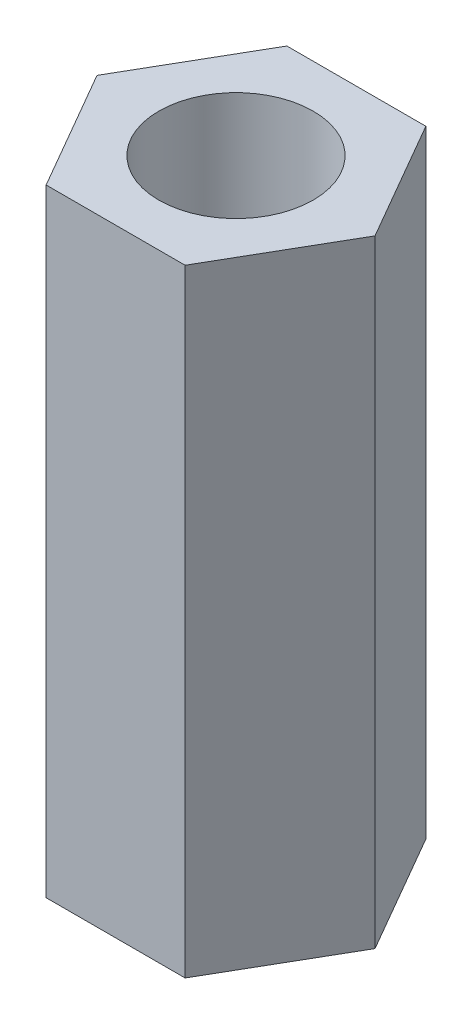
ISO-10303-21;
HEADER;
FILE_DESCRIPTION(('STEP AP214'),'2;1');
FILE_NAME('part.step','',(''),(''),'','','');
FILE_SCHEMA(('AUTOMOTIVE_DESIGN { 1 0 10303 214 1 1 1 1 }'));
ENDSEC;
DATA;
#1=APPLICATION_CONTEXT('core data for automotive mechanical design processes');
#2=APPLICATION_PROTOCOL_DEFINITION('international standard','automotive_design',2000,#1);
#3=PRODUCT_CONTEXT('',#1,'mechanical');
#4=PRODUCT('Part','Part','',(#3));
#5=PRODUCT_RELATED_PRODUCT_CATEGORY('part','',(#4));
#6=PRODUCT_DEFINITION_FORMATION('','',#4);
#7=PRODUCT_DEFINITION_CONTEXT('part definition',#1,'design');
#8=PRODUCT_DEFINITION('design','',#6,#7);
#9=PRODUCT_DEFINITION_SHAPE('','',#8);
#10=(LENGTH_UNIT() NAMED_UNIT(*) SI_UNIT(.MILLI.,.METRE.));
#11=(NAMED_UNIT(*) PLANE_ANGLE_UNIT() SI_UNIT($,.RADIAN.));
#12=(NAMED_UNIT(*) SI_UNIT($,.STERADIAN.) SOLID_ANGLE_UNIT());
#13=UNCERTAINTY_MEASURE_WITH_UNIT(LENGTH_MEASURE(1.E-05),#10,'distance_accuracy_value','');
#14=(GEOMETRIC_REPRESENTATION_CONTEXT(3) GLOBAL_UNCERTAINTY_ASSIGNED_CONTEXT((#13)) GLOBAL_UNIT_ASSIGNED_CONTEXT((#10,
#11,#12)) REPRESENTATION_CONTEXT('',''));
#15=CARTESIAN_POINT('',(0.,0.,0.));
#16=DIRECTION('',(0.,0.,1.));
#17=DIRECTION('',(1.,0.,0.));
#18=AXIS2_PLACEMENT_3D('',#15,#16,#17);
#19=CARTESIAN_POINT('',(1.12583302491977,10.,1.95));
#20=DIRECTION('',(-0.866025403784439,0.,-0.5));
#21=DIRECTION('',(-0.5,0.,0.866025403784439));
#22=AXIS2_PLACEMENT_3D('',#19,#20,#21);
#23=PLANE('',#22);
#24=DIRECTION('',(0.5,0.,-0.866025403784439));
#25=VECTOR('',#24,1.);
#26=CARTESIAN_POINT('',(1.12583302491977,0.,1.95));
#27=LINE('',#26,#25);
#28=CARTESIAN_POINT('',(1.12583302491977,0.,1.95));
#29=VERTEX_POINT('',#28);
#30=CARTESIAN_POINT('',(2.25166604983954,0.,0.));
#31=VERTEX_POINT('',#30);
#32=EDGE_CURVE('E119',#29,#31,#27,.T.);
#33=ORIENTED_EDGE('',*,*,#32,.T.);
#34=DIRECTION('',(0.,-1.,0.));
#35=VECTOR('',#34,1.);
#36=CARTESIAN_POINT('',(2.25166604983954,10.,0.));
#37=LINE('',#36,#35);
#38=CARTESIAN_POINT('',(2.25166604983954,10.,0.));
#39=VERTEX_POINT('',#38);
#40=EDGE_CURVE('E11',#39,#31,#37,.T.);
#41=ORIENTED_EDGE('',*,*,#40,.F.);
#42=DIRECTION('',(0.5,0.,-0.866025403784439));
#43=VECTOR('',#42,1.);
#44=CARTESIAN_POINT('',(1.12583302491977,10.,1.95));
#45=LINE('',#44,#43);
#46=CARTESIAN_POINT('',(1.12583302491977,10.,1.95));
#47=VERTEX_POINT('',#46);
#48=EDGE_CURVE('E130',#47,#39,#45,.T.);
#49=ORIENTED_EDGE('',*,*,#48,.F.);
#50=DIRECTION('',(0.,-1.,0.));
#51=VECTOR('',#50,1.);
#52=CARTESIAN_POINT('',(1.12583302491977,10.,1.95));
#53=LINE('',#52,#51);
#54=EDGE_CURVE('E115',#47,#29,#53,.T.);
#55=ORIENTED_EDGE('',*,*,#54,.T.);
#56=EDGE_LOOP('',(#33,#41,#49,#55));
#57=FACE_BOUND('',#56,.T.);
#58=ADVANCED_FACE('F35',(#57),#23,.F.);
#59=CARTESIAN_POINT('',(2.25166604983954,10.,0.));
#60=DIRECTION('',(-0.866025403784439,0.,0.5));
#61=DIRECTION('',(0.5,0.,0.866025403784439));
#62=AXIS2_PLACEMENT_3D('',#59,#60,#61);
#63=PLANE('',#62);
#64=DIRECTION('',(-0.5,0.,-0.866025403784439));
#65=VECTOR('',#64,1.);
#66=CARTESIAN_POINT('',(2.25166604983954,0.,0.));
#67=LINE('',#66,#65);
#68=CARTESIAN_POINT('',(1.12583302491977,0.,-1.95));
#69=VERTEX_POINT('',#68);
#70=EDGE_CURVE('E122',#31,#69,#67,.T.);
#71=ORIENTED_EDGE('',*,*,#70,.T.);
#72=DIRECTION('',(0.,-1.,0.));
#73=VECTOR('',#72,1.);
#74=CARTESIAN_POINT('',(1.12583302491977,10.,-1.95));
#75=LINE('',#74,#73);
#76=CARTESIAN_POINT('',(1.12583302491977,10.,-1.95));
#77=VERTEX_POINT('',#76);
#78=EDGE_CURVE('E43',#77,#69,#75,.T.);
#79=ORIENTED_EDGE('',*,*,#78,.F.);
#80=DIRECTION('',(-0.5,0.,-0.866025403784439));
#81=VECTOR('',#80,1.);
#82=CARTESIAN_POINT('',(2.25166604983954,10.,0.));
#83=LINE('',#82,#81);
#84=EDGE_CURVE('E88',#39,#77,#83,.T.);
#85=ORIENTED_EDGE('',*,*,#84,.F.);
#86=ORIENTED_EDGE('',*,*,#40,.T.);
#87=EDGE_LOOP('',(#71,#79,#85,#86));
#88=FACE_BOUND('',#87,.T.);
#89=ADVANCED_FACE('F155',(#88),#63,.F.);
#90=CARTESIAN_POINT('',(1.12583302491977,10.,-1.95));
#91=DIRECTION('',(0.,0.,1.));
#92=DIRECTION('',(1.,0.,0.));
#93=AXIS2_PLACEMENT_3D('',#90,#91,#92);
#94=PLANE('',#93);
#95=DIRECTION('',(-1.,0.,0.));
#96=VECTOR('',#95,1.);
#97=CARTESIAN_POINT('',(1.12583302491977,0.,-1.95));
#98=LINE('',#97,#96);
#99=CARTESIAN_POINT('',(-1.12583302491977,0.,-1.95));
#100=VERTEX_POINT('',#99);
#101=EDGE_CURVE('E125',#69,#100,#98,.T.);
#102=ORIENTED_EDGE('',*,*,#101,.T.);
#103=DIRECTION('',(0.,-1.,0.));
#104=VECTOR('',#103,1.);
#105=CARTESIAN_POINT('',(-1.12583302491977,10.,-1.95));
#106=LINE('',#105,#104);
#107=CARTESIAN_POINT('',(-1.12583302491977,10.,-1.95));
#108=VERTEX_POINT('',#107);
#109=EDGE_CURVE('E110',#108,#100,#106,.T.);
#110=ORIENTED_EDGE('',*,*,#109,.F.);
#111=DIRECTION('',(-1.,0.,0.));
#112=VECTOR('',#111,1.);
#113=CARTESIAN_POINT('',(1.12583302491977,10.,-1.95));
#114=LINE('',#113,#112);
#115=EDGE_CURVE('E101',#77,#108,#114,.T.);
#116=ORIENTED_EDGE('',*,*,#115,.F.);
#117=ORIENTED_EDGE('',*,*,#78,.T.);
#118=EDGE_LOOP('',(#102,#110,#116,#117));
#119=FACE_BOUND('',#118,.T.);
#120=ADVANCED_FACE('F136',(#119),#94,.F.);
#121=CARTESIAN_POINT('',(-1.12583302491977,10.,-1.95));
#122=DIRECTION('',(0.866025403784439,0.,0.5));
#123=DIRECTION('',(0.5,0.,-0.866025403784439));
#124=AXIS2_PLACEMENT_3D('',#121,#122,#123);
#125=PLANE('',#124);
#126=DIRECTION('',(-0.5,0.,0.866025403784439));
#127=VECTOR('',#126,1.);
#128=CARTESIAN_POINT('',(-1.12583302491977,0.,-1.95));
#129=LINE('',#128,#127);
#130=CARTESIAN_POINT('',(-2.25166604983954,0.,0.));
#131=VERTEX_POINT('',#130);
#132=EDGE_CURVE('E109',#100,#131,#129,.T.);
#133=ORIENTED_EDGE('',*,*,#132,.T.);
#134=DIRECTION('',(0.,-1.,0.));
#135=VECTOR('',#134,1.);
#136=CARTESIAN_POINT('',(-2.25166604983954,10.,0.));
#137=LINE('',#136,#135);
#138=CARTESIAN_POINT('',(-2.25166604983954,10.,0.));
#139=VERTEX_POINT('',#138);
#140=EDGE_CURVE('E106',#139,#131,#137,.T.);
#141=ORIENTED_EDGE('',*,*,#140,.F.);
#142=DIRECTION('',(-0.5,0.,0.866025403784439));
#143=VECTOR('',#142,1.);
#144=CARTESIAN_POINT('',(-1.12583302491977,10.,-1.95));
#145=LINE('',#144,#143);
#146=EDGE_CURVE('E95',#108,#139,#145,.T.);
#147=ORIENTED_EDGE('',*,*,#146,.F.);
#148=ORIENTED_EDGE('',*,*,#109,.T.);
#149=EDGE_LOOP('',(#133,#141,#147,#148));
#150=FACE_BOUND('',#149,.T.);
#151=ADVANCED_FACE('F107',(#150),#125,.F.);
#152=CARTESIAN_POINT('',(-2.25166604983954,10.,0.));
#153=DIRECTION('',(0.866025403784439,0.,-0.5));
#154=DIRECTION('',(-0.5,0.,-0.866025403784439));
#155=AXIS2_PLACEMENT_3D('',#152,#153,#154);
#156=PLANE('',#155);
#157=DIRECTION('',(0.5,0.,0.866025403784439));
#158=VECTOR('',#157,1.);
#159=CARTESIAN_POINT('',(-2.25166604983954,0.,0.));
#160=LINE('',#159,#158);
#161=CARTESIAN_POINT('',(-1.12583302491977,0.,1.95));
#162=VERTEX_POINT('',#161);
#163=EDGE_CURVE('E74',#131,#162,#160,.T.);
#164=ORIENTED_EDGE('',*,*,#163,.T.);
#165=DIRECTION('',(0.,-1.,0.));
#166=VECTOR('',#165,1.);
#167=CARTESIAN_POINT('',(-1.12583302491977,10.,1.95));
#168=LINE('',#167,#166);
#169=CARTESIAN_POINT('',(-1.12583302491977,10.,1.95));
#170=VERTEX_POINT('',#169);
#171=EDGE_CURVE('E111',#170,#162,#168,.T.);
#172=ORIENTED_EDGE('',*,*,#171,.F.);
#173=DIRECTION('',(0.5,0.,0.866025403784439));
#174=VECTOR('',#173,1.);
#175=CARTESIAN_POINT('',(-2.25166604983954,10.,0.));
#176=LINE('',#175,#174);
#177=EDGE_CURVE('E99',#139,#170,#176,.T.);
#178=ORIENTED_EDGE('',*,*,#177,.F.);
#179=ORIENTED_EDGE('',*,*,#140,.T.);
#180=EDGE_LOOP('',(#164,#172,#178,#179));
#181=FACE_BOUND('',#180,.T.);
#182=ADVANCED_FACE('F113',(#181),#156,.F.);
#183=CARTESIAN_POINT('',(-1.12583302491977,10.,1.95));
#184=DIRECTION('',(0.,0.,-1.));
#185=DIRECTION('',(-1.,0.,0.));
#186=AXIS2_PLACEMENT_3D('',#183,#184,#185);
#187=PLANE('',#186);
#188=DIRECTION('',(1.,0.,0.));
#189=VECTOR('',#188,1.);
#190=CARTESIAN_POINT('',(-1.12583302491977,0.,1.95));
#191=LINE('',#190,#189);
#192=EDGE_CURVE('E80',#162,#29,#191,.T.);
#193=ORIENTED_EDGE('',*,*,#192,.T.);
#194=ORIENTED_EDGE('',*,*,#54,.F.);
#195=DIRECTION('',(1.,0.,0.));
#196=VECTOR('',#195,1.);
#197=CARTESIAN_POINT('',(-1.12583302491977,10.,1.95));
#198=LINE('',#197,#196);
#199=EDGE_CURVE('E51',#170,#47,#198,.T.);
#200=ORIENTED_EDGE('',*,*,#199,.F.);
#201=ORIENTED_EDGE('',*,*,#171,.T.);
#202=EDGE_LOOP('',(#193,#194,#200,#201));
#203=FACE_BOUND('',#202,.T.);
#204=ADVANCED_FACE('F143',(#203),#187,.F.);
#205=CARTESIAN_POINT('',(0.,10.,0.));
#206=DIRECTION('',(0.,1.,0.));
#207=DIRECTION('',(0.,0.,1.));
#208=AXIS2_PLACEMENT_3D('',#205,#206,#207);
#209=PLANE('',#208);
#210=CARTESIAN_POINT('',(0.,10.,0.));
#211=DIRECTION('',(0.,1.,0.));
#212=DIRECTION('',(0.,0.,1.));
#213=AXIS2_PLACEMENT_3D('',#210,#211,#212);
#214=CIRCLE('',#213,1.25);
#215=CARTESIAN_POINT('',(0.,10.,1.25));
#216=VERTEX_POINT('',#215);
#217=EDGE_CURVE('E210',#216,#216,#214,.T.);
#218=ORIENTED_EDGE('',*,*,#217,.F.);
#219=EDGE_LOOP('',(#218));
#220=FACE_BOUND('',#219,.T.);
#221=ORIENTED_EDGE('',*,*,#48,.T.);
#222=ORIENTED_EDGE('',*,*,#84,.T.);
#223=ORIENTED_EDGE('',*,*,#115,.T.);
#224=ORIENTED_EDGE('',*,*,#146,.T.);
#225=ORIENTED_EDGE('',*,*,#177,.T.);
#226=ORIENTED_EDGE('',*,*,#199,.T.);
#227=EDGE_LOOP('',(#221,#222,#223,#224,#225,#226));
#228=FACE_BOUND('',#227,.T.);
#229=ADVANCED_FACE('F97',(#220,#228),#209,.T.);
#230=CARTESIAN_POINT('',(0.,0.,0.));
#231=DIRECTION('',(0.,1.,0.));
#232=DIRECTION('',(0.,0.,1.));
#233=AXIS2_PLACEMENT_3D('',#230,#231,#232);
#234=PLANE('',#233);
#235=CARTESIAN_POINT('',(0.,0.,0.));
#236=DIRECTION('',(0.,1.,0.));
#237=DIRECTION('',(0.,0.,1.));
#238=AXIS2_PLACEMENT_3D('',#235,#236,#237);
#239=CIRCLE('',#238,1.25);
#240=CARTESIAN_POINT('',(0.,0.,1.25));
#241=VERTEX_POINT('',#240);
#242=EDGE_CURVE('E123',#241,#241,#239,.T.);
#243=ORIENTED_EDGE('',*,*,#242,.T.);
#244=EDGE_LOOP('',(#243));
#245=FACE_BOUND('',#244,.T.);
#246=ORIENTED_EDGE('',*,*,#32,.F.);
#247=ORIENTED_EDGE('',*,*,#192,.F.);
#248=ORIENTED_EDGE('',*,*,#163,.F.);
#249=ORIENTED_EDGE('',*,*,#132,.F.);
#250=ORIENTED_EDGE('',*,*,#101,.F.);
#251=ORIENTED_EDGE('',*,*,#70,.F.);
#252=EDGE_LOOP('',(#246,#247,#248,#249,#250,#251));
#253=FACE_BOUND('',#252,.T.);
#254=ADVANCED_FACE('F139',(#245,#253),#234,.F.);
#255=CARTESIAN_POINT('',(0.,0.,0.));
#256=DIRECTION('',(0.,1.,0.));
#257=DIRECTION('',(0.,0.,1.));
#258=AXIS2_PLACEMENT_3D('',#255,#256,#257);
#259=CYLINDRICAL_SURFACE('',#258,1.25);
#260=ORIENTED_EDGE('',*,*,#242,.F.);
#261=EDGE_LOOP('',(#260));
#262=FACE_BOUND('',#261,.T.);
#263=ORIENTED_EDGE('',*,*,#217,.T.);
#264=EDGE_LOOP('',(#263));
#265=FACE_BOUND('',#264,.T.);
#266=ADVANCED_FACE('F192',(#262,#265),#259,.F.);
#267=CLOSED_SHELL('',(#58,#89,#120,#151,#182,#204,#229,#254,#266));
#268=MANIFOLD_SOLID_BREP('B2',#267);
#269=ADVANCED_BREP_SHAPE_REPRESENTATION('',(#18,#268),#14);
#270=SHAPE_DEFINITION_REPRESENTATION(#9,#269);
ENDSEC;
END-ISO-10303-21;
